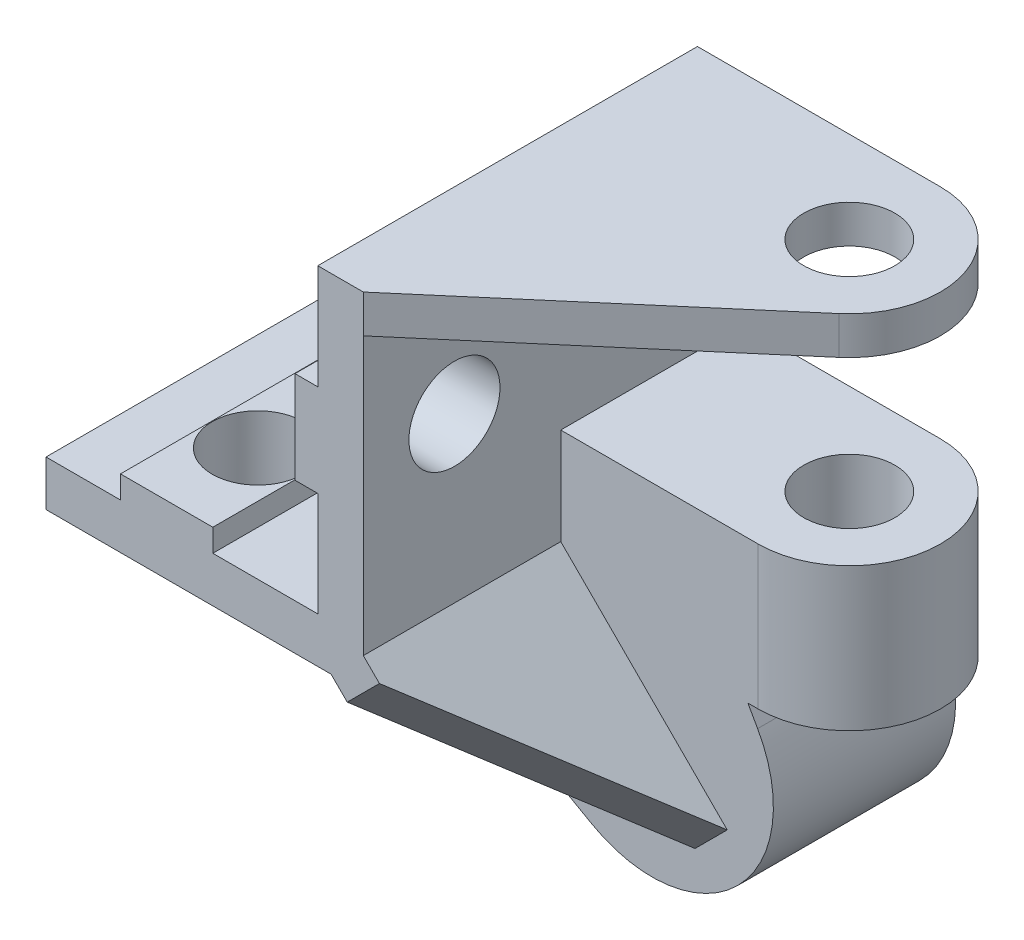
ISO-10303-21;
HEADER;
FILE_DESCRIPTION(('STEP AP214'),'2;1');
FILE_NAME('part.step','',(''),(''),'','','');
FILE_SCHEMA(('AUTOMOTIVE_DESIGN { 1 0 10303 214 1 1 1 1 }'));
ENDSEC;
DATA;
#1=APPLICATION_CONTEXT('core data for automotive mechanical design processes');
#2=APPLICATION_PROTOCOL_DEFINITION('international standard','automotive_design',2000,#1);
#3=PRODUCT_CONTEXT('',#1,'mechanical');
#4=PRODUCT('Part','Part','',(#3));
#5=PRODUCT_RELATED_PRODUCT_CATEGORY('part','',(#4));
#6=PRODUCT_DEFINITION_FORMATION('','',#4);
#7=PRODUCT_DEFINITION_CONTEXT('part definition',#1,'design');
#8=PRODUCT_DEFINITION('design','',#6,#7);
#9=PRODUCT_DEFINITION_SHAPE('','',#8);
#10=(LENGTH_UNIT() NAMED_UNIT(*) SI_UNIT(.MILLI.,.METRE.));
#11=(NAMED_UNIT(*) PLANE_ANGLE_UNIT() SI_UNIT($,.RADIAN.));
#12=(NAMED_UNIT(*) SI_UNIT($,.STERADIAN.) SOLID_ANGLE_UNIT());
#13=UNCERTAINTY_MEASURE_WITH_UNIT(LENGTH_MEASURE(1.E-05),#10,'distance_accuracy_value','');
#14=(GEOMETRIC_REPRESENTATION_CONTEXT(3) GLOBAL_UNCERTAINTY_ASSIGNED_CONTEXT((#13)) GLOBAL_UNIT_ASSIGNED_CONTEXT((#10,
#11,#12)) REPRESENTATION_CONTEXT('',''));
#15=CARTESIAN_POINT('',(0.,0.,0.));
#16=DIRECTION('',(0.,0.,1.));
#17=DIRECTION('',(1.,0.,0.));
#18=AXIS2_PLACEMENT_3D('',#15,#16,#17);
#19=CARTESIAN_POINT('',(230.088719843331,41.429550862018,-25.));
#20=DIRECTION('',(1.,0.,0.));
#21=DIRECTION('',(0.,0.,-1.));
#22=AXIS2_PLACEMENT_3D('',#19,#20,#21);
#23=PLANE('',#22);
#24=CARTESIAN_POINT('',(230.088719843331,54.3395711724228,-6.));
#25=DIRECTION('',(1.,0.,0.));
#26=DIRECTION('',(0.,0.,-1.));
#27=AXIS2_PLACEMENT_3D('',#24,#25,#26);
#28=CIRCLE('',#27,3.);
#29=CARTESIAN_POINT('',(230.088719843331,54.3395711724228,-9.));
#30=VERTEX_POINT('',#29);
#31=EDGE_CURVE('E315',#30,#30,#28,.T.);
#32=ORIENTED_EDGE('',*,*,#31,.F.);
#33=EDGE_LOOP('',(#32));
#34=FACE_BOUND('',#33,.T.);
#35=DIRECTION('',(0.,0.,1.));
#36=VECTOR('',#35,1.);
#37=CARTESIAN_POINT('',(230.088719843331,61.7829711724228,-25.));
#38=LINE('',#37,#36);
#39=CARTESIAN_POINT('',(230.088719843331,61.7829711724228,-25.));
#40=VERTEX_POINT('',#39);
#41=CARTESIAN_POINT('',(230.088719843331,61.7829711724228,0.));
#42=VERTEX_POINT('',#41);
#43=EDGE_CURVE('E228',#40,#42,#38,.T.);
#44=ORIENTED_EDGE('',*,*,#43,.T.);
#45=DIRECTION('',(0.,1.,0.));
#46=VECTOR('',#45,1.);
#47=CARTESIAN_POINT('',(230.088719843331,41.429550862018,0.));
#48=LINE('',#47,#46);
#49=CARTESIAN_POINT('',(230.088719843331,43.5504865618593,0.));
#50=VERTEX_POINT('',#49);
#51=EDGE_CURVE('E231',#50,#42,#48,.T.);
#52=ORIENTED_EDGE('',*,*,#51,.F.);
#53=DIRECTION('',(0.,0.,-1.));
#54=VECTOR('',#53,1.);
#55=CARTESIAN_POINT('',(230.088719843331,43.5504865618593,-25.));
#56=LINE('',#55,#54);
#57=CARTESIAN_POINT('',(230.088719843331,43.5504865618593,-13.));
#58=VERTEX_POINT('',#57);
#59=EDGE_CURVE('E324',#50,#58,#56,.T.);
#60=ORIENTED_EDGE('',*,*,#59,.T.);
#61=DIRECTION('',(0.,1.,0.));
#62=VECTOR('',#61,1.);
#63=CARTESIAN_POINT('',(230.088719843331,41.429550862018,-13.));
#64=LINE('',#63,#62);
#65=CARTESIAN_POINT('',(230.088719843331,49.9129711724228,-13.));
#66=VERTEX_POINT('',#65);
#67=EDGE_CURVE('E65',#58,#66,#64,.T.);
#68=ORIENTED_EDGE('',*,*,#67,.T.);
#69=DIRECTION('',(0.,0.,1.));
#70=VECTOR('',#69,1.);
#71=CARTESIAN_POINT('',(230.088719843331,49.9129711724228,-25.));
#72=LINE('',#71,#70);
#73=CARTESIAN_POINT('',(230.088719843331,49.9129711724228,-25.));
#74=VERTEX_POINT('',#73);
#75=EDGE_CURVE('E518',#74,#66,#72,.T.);
#76=ORIENTED_EDGE('',*,*,#75,.F.);
#77=DIRECTION('',(0.,1.,0.));
#78=VECTOR('',#77,1.);
#79=CARTESIAN_POINT('',(230.088719843331,41.429550862018,-25.));
#80=LINE('',#79,#78);
#81=EDGE_CURVE('E234',#74,#40,#80,.T.);
#82=ORIENTED_EDGE('',*,*,#81,.T.);
#83=EDGE_LOOP('',(#44,#52,#60,#68,#76,#82));
#84=FACE_BOUND('',#83,.T.);
#85=ADVANCED_FACE('F38',(#34,#84),#23,.T.);
#86=CARTESIAN_POINT('',(243.088719843331,61.7829711724228,-19.));
#87=DIRECTION('',(0.,1.,0.));
#88=DIRECTION('',(-1.,0.,0.));
#89=AXIS2_PLACEMENT_3D('',#86,#87,#88);
#90=CYLINDRICAL_SURFACE('',#89,6.);
#91=CARTESIAN_POINT('',(243.088719843331,64.2829711724228,-19.));
#92=DIRECTION('',(0.,1.,0.));
#93=DIRECTION('',(-1.,0.,0.));
#94=AXIS2_PLACEMENT_3D('',#91,#92,#93);
#95=CIRCLE('',#94,6.);
#96=CARTESIAN_POINT('',(246.986411594051,64.2829711724228,-14.4384214337176));
#97=VERTEX_POINT('',#96);
#98=CARTESIAN_POINT('',(243.088719843331,64.2829711724228,-25.));
#99=VERTEX_POINT('',#98);
#100=EDGE_CURVE('E525',#97,#99,#95,.T.);
#101=ORIENTED_EDGE('',*,*,#100,.F.);
#102=DIRECTION('',(0.,1.,0.));
#103=VECTOR('',#102,1.);
#104=CARTESIAN_POINT('',(246.986411594051,61.7829711724228,-14.4384214337176));
#105=LINE('',#104,#103);
#106=CARTESIAN_POINT('',(246.986411594051,61.7829711724228,-14.4384214337176));
#107=VERTEX_POINT('',#106);
#108=EDGE_CURVE('E251',#107,#97,#105,.T.);
#109=ORIENTED_EDGE('',*,*,#108,.F.);
#110=CARTESIAN_POINT('',(243.088719843331,61.7829711724228,-19.));
#111=DIRECTION('',(0.,1.,0.));
#112=DIRECTION('',(-1.,0.,0.));
#113=AXIS2_PLACEMENT_3D('',#110,#111,#112);
#114=CIRCLE('',#113,6.);
#115=CARTESIAN_POINT('',(243.088719843331,61.7829711724228,-25.));
#116=VERTEX_POINT('',#115);
#117=EDGE_CURVE('E255',#107,#116,#114,.T.);
#118=ORIENTED_EDGE('',*,*,#117,.T.);
#119=DIRECTION('',(0.,1.,0.));
#120=VECTOR('',#119,1.);
#121=CARTESIAN_POINT('',(243.088719843331,61.7829711724228,-25.));
#122=LINE('',#121,#120);
#123=EDGE_CURVE('E241',#116,#99,#122,.T.);
#124=ORIENTED_EDGE('',*,*,#123,.T.);
#125=EDGE_LOOP('',(#101,#109,#118,#124));
#126=FACE_BOUND('',#125,.T.);
#127=ADVANCED_FACE('F556',(#126),#90,.T.);
#128=CARTESIAN_POINT('',(237.925828105949,48.429550862018,-13.));
#129=DIRECTION('',(0.870376693630431,0.492386444964683,0.));
#130=DIRECTION('',(-0.492386444964683,0.870376693630431,0.));
#131=AXIS2_PLACEMENT_3D('',#128,#129,#130);
#132=PLANE('',#131);
#133=DIRECTION('',(0.492386444964683,-0.870376693630431,0.));
#134=VECTOR('',#133,1.);
#135=CARTESIAN_POINT('',(237.925828105949,48.429550862018,-25.));
#136=LINE('',#135,#134);
#137=CARTESIAN_POINT('',(242.409313998279,40.5042278422419,-25.));
#138=VERTEX_POINT('',#137);
#139=CARTESIAN_POINT('',(243.051733392374,39.3686424217354,-25.));
#140=VERTEX_POINT('',#139);
#141=EDGE_CURVE('E355',#138,#140,#136,.T.);
#142=ORIENTED_EDGE('',*,*,#141,.F.);
#143=DIRECTION('',(0.,0.,1.));
#144=VECTOR('',#143,1.);
#145=CARTESIAN_POINT('',(242.409313998279,40.5042278422419,-13.));
#146=LINE('',#145,#144);
#147=CARTESIAN_POINT('',(242.409313998279,40.5042278422419,-13.));
#148=VERTEX_POINT('',#147);
#149=EDGE_CURVE('E495',#138,#148,#146,.T.);
#150=ORIENTED_EDGE('',*,*,#149,.T.);
#151=DIRECTION('',(0.492386444964683,-0.870376693630431,0.));
#152=VECTOR('',#151,1.);
#153=CARTESIAN_POINT('',(237.925828105949,48.429550862018,-13.));
#154=LINE('',#153,#152);
#155=CARTESIAN_POINT('',(243.051733392374,39.3686424217354,-13.));
#156=VERTEX_POINT('',#155);
#157=EDGE_CURVE('E335',#148,#156,#154,.T.);
#158=ORIENTED_EDGE('',*,*,#157,.T.);
#159=DIRECTION('',(0.,0.,-1.));
#160=VECTOR('',#159,1.);
#161=CARTESIAN_POINT('',(243.051733392374,39.3686424217354,-13.));
#162=LINE('',#161,#160);
#163=EDGE_CURVE('E368',#156,#140,#162,.T.);
#164=ORIENTED_EDGE('',*,*,#163,.T.);
#165=EDGE_LOOP('',(#142,#150,#158,#164));
#166=FACE_BOUND('',#165,.T.);
#167=ADVANCED_FACE('F562',(#166),#132,.T.);
#168=CARTESIAN_POINT('',(209.195275179556,41.429550862018,-25.));
#169=DIRECTION('',(0.,-1.,0.));
#170=DIRECTION('',(0.,0.,-1.));
#171=AXIS2_PLACEMENT_3D('',#168,#169,#170);
#172=PLANE('',#171);
#173=DIRECTION('',(0.,0.,-1.));
#174=VECTOR('',#173,1.);
#175=CARTESIAN_POINT('',(227.967014646705,41.429550862018,-25.));
#176=LINE('',#175,#174);
#177=CARTESIAN_POINT('',(227.967014646705,41.429550862018,0.));
#178=VERTEX_POINT('',#177);
#179=CARTESIAN_POINT('',(227.967014646705,41.429550862018,-13.));
#180=VERTEX_POINT('',#179);
#181=EDGE_CURVE('E339',#178,#180,#176,.T.);
#182=ORIENTED_EDGE('',*,*,#181,.F.);
#183=DIRECTION('',(1.,0.,0.));
#184=VECTOR('',#183,1.);
#185=CARTESIAN_POINT('',(209.195275179556,41.429550862018,0.));
#186=LINE('',#185,#184);
#187=CARTESIAN_POINT('',(209.195275179556,41.429550862018,0.));
#188=VERTEX_POINT('',#187);
#189=EDGE_CURVE('E264',#188,#178,#186,.T.);
#190=ORIENTED_EDGE('',*,*,#189,.F.);
#191=DIRECTION('',(0.,0.,1.));
#192=VECTOR('',#191,1.);
#193=CARTESIAN_POINT('',(209.195275179556,41.429550862018,-25.));
#194=LINE('',#193,#192);
#195=CARTESIAN_POINT('',(209.195275179556,41.429550862018,-13.));
#196=VERTEX_POINT('',#195);
#197=EDGE_CURVE('E279',#196,#188,#194,.T.);
#198=ORIENTED_EDGE('',*,*,#197,.F.);
#199=DIRECTION('',(1.,0.,0.));
#200=VECTOR('',#199,1.);
#201=CARTESIAN_POINT('',(209.195275179556,41.429550862018,-13.));
#202=LINE('',#201,#200);
#203=EDGE_CURVE('E336',#196,#180,#202,.T.);
#204=ORIENTED_EDGE('',*,*,#203,.T.);
#205=EDGE_LOOP('',(#182,#190,#198,#204));
#206=FACE_BOUND('',#205,.T.);
#207=CARTESIAN_POINT('',(217.138695007103,41.429550862018,-6.));
#208=DIRECTION('',(0.,-1.,0.));
#209=DIRECTION('',(0.,0.,-1.));
#210=AXIS2_PLACEMENT_3D('',#207,#208,#209);
#211=CIRCLE('',#210,2.99999999999999);
#212=CARTESIAN_POINT('',(217.138695007103,41.429550862018,-8.99999999999999));
#213=VERTEX_POINT('',#212);
#214=EDGE_CURVE('E320',#213,#213,#211,.T.);
#215=ORIENTED_EDGE('',*,*,#214,.F.);
#216=EDGE_LOOP('',(#215));
#217=FACE_BOUND('',#216,.T.);
#218=ADVANCED_FACE('F455',(#206,#217),#172,.T.);
#219=CARTESIAN_POINT('',(209.195275179556,44.429550862018,-25.));
#220=DIRECTION('',(-1.,0.,0.));
#221=DIRECTION('',(0.,-1.,0.));
#222=AXIS2_PLACEMENT_3D('',#219,#220,#221);
#223=PLANE('',#222);
#224=DIRECTION('',(0.,-1.,0.));
#225=VECTOR('',#224,1.);
#226=CARTESIAN_POINT('',(209.195275179556,44.429550862018,0.));
#227=LINE('',#226,#225);
#228=CARTESIAN_POINT('',(209.195275179556,44.429550862018,0.));
#229=VERTEX_POINT('',#228);
#230=EDGE_CURVE('E272',#229,#188,#227,.T.);
#231=ORIENTED_EDGE('',*,*,#230,.F.);
#232=DIRECTION('',(0.,0.,1.));
#233=VECTOR('',#232,1.);
#234=CARTESIAN_POINT('',(209.195275179556,44.429550862018,-25.));
#235=LINE('',#234,#233);
#236=CARTESIAN_POINT('',(209.195275179556,44.429550862018,-25.));
#237=VERTEX_POINT('',#236);
#238=EDGE_CURVE('E280',#237,#229,#235,.T.);
#239=ORIENTED_EDGE('',*,*,#238,.F.);
#240=DIRECTION('',(0.,-1.,0.));
#241=VECTOR('',#240,1.);
#242=CARTESIAN_POINT('',(209.195275179556,44.429550862018,-25.));
#243=LINE('',#242,#241);
#244=CARTESIAN_POINT('',(209.195275179556,41.429550862018,-25.));
#245=VERTEX_POINT('',#244);
#246=EDGE_CURVE('E405',#237,#245,#243,.T.);
#247=ORIENTED_EDGE('',*,*,#246,.T.);
#248=EDGE_CURVE('E276',#245,#196,#194,.T.);
#249=ORIENTED_EDGE('',*,*,#248,.T.);
#250=ORIENTED_EDGE('',*,*,#197,.T.);
#251=EDGE_LOOP('',(#231,#239,#247,#249,#250));
#252=FACE_BOUND('',#251,.T.);
#253=ADVANCED_FACE('F450',(#252),#223,.T.);
#254=CARTESIAN_POINT('',(214.098687418949,44.429550862018,-25.));
#255=DIRECTION('',(0.,1.,0.));
#256=DIRECTION('',(-1.,0.,0.));
#257=AXIS2_PLACEMENT_3D('',#254,#255,#256);
#258=PLANE('',#257);
#259=DIRECTION('',(-1.,0.,0.));
#260=VECTOR('',#259,1.);
#261=CARTESIAN_POINT('',(214.098687418949,44.429550862018,0.));
#262=LINE('',#261,#260);
#263=CARTESIAN_POINT('',(214.098687418949,44.429550862018,0.));
#264=VERTEX_POINT('',#263);
#265=EDGE_CURVE('E441',#264,#229,#262,.T.);
#266=ORIENTED_EDGE('',*,*,#265,.F.);
#267=DIRECTION('',(0.,0.,1.));
#268=VECTOR('',#267,1.);
#269=CARTESIAN_POINT('',(214.098687418949,44.429550862018,-25.));
#270=LINE('',#269,#268);
#271=CARTESIAN_POINT('',(214.098687418949,44.429550862018,-25.));
#272=VERTEX_POINT('',#271);
#273=EDGE_CURVE('E283',#272,#264,#270,.T.);
#274=ORIENTED_EDGE('',*,*,#273,.F.);
#275=DIRECTION('',(-1.,0.,0.));
#276=VECTOR('',#275,1.);
#277=CARTESIAN_POINT('',(214.098687418949,44.429550862018,-25.));
#278=LINE('',#277,#276);
#279=EDGE_CURVE('E401',#272,#237,#278,.T.);
#280=ORIENTED_EDGE('',*,*,#279,.T.);
#281=ORIENTED_EDGE('',*,*,#238,.T.);
#282=EDGE_LOOP('',(#266,#274,#280,#281));
#283=FACE_BOUND('',#282,.T.);
#284=ADVANCED_FACE('F571',(#283),#258,.T.);
#285=CARTESIAN_POINT('',(214.098687418949,45.9171950677049,-25.));
#286=DIRECTION('',(-1.,0.,0.));
#287=DIRECTION('',(0.,0.,1.));
#288=AXIS2_PLACEMENT_3D('',#285,#286,#287);
#289=PLANE('',#288);
#290=DIRECTION('',(0.,-1.,0.));
#291=VECTOR('',#290,1.);
#292=CARTESIAN_POINT('',(214.098687418949,45.9171950677049,0.));
#293=LINE('',#292,#291);
#294=CARTESIAN_POINT('',(214.098687418949,45.9171950677049,0.));
#295=VERTEX_POINT('',#294);
#296=EDGE_CURVE('E438',#295,#264,#293,.T.);
#297=ORIENTED_EDGE('',*,*,#296,.F.);
#298=DIRECTION('',(0.,0.,1.));
#299=VECTOR('',#298,1.);
#300=CARTESIAN_POINT('',(214.098687418949,45.9171950677049,-25.));
#301=LINE('',#300,#299);
#302=CARTESIAN_POINT('',(214.098687418949,45.9171950677049,-25.));
#303=VERTEX_POINT('',#302);
#304=EDGE_CURVE('E286',#303,#295,#301,.T.);
#305=ORIENTED_EDGE('',*,*,#304,.F.);
#306=DIRECTION('',(0.,-1.,0.));
#307=VECTOR('',#306,1.);
#308=CARTESIAN_POINT('',(214.098687418949,45.9171950677049,-25.));
#309=LINE('',#308,#307);
#310=EDGE_CURVE('E397',#303,#272,#309,.T.);
#311=ORIENTED_EDGE('',*,*,#310,.T.);
#312=ORIENTED_EDGE('',*,*,#273,.T.);
#313=EDGE_LOOP('',(#297,#305,#311,#312));
#314=FACE_BOUND('',#313,.T.);
#315=ADVANCED_FACE('F574',(#314),#289,.T.);
#316=CARTESIAN_POINT('',(220.178702595257,45.9171950677049,-25.));
#317=DIRECTION('',(0.,1.,0.));
#318=DIRECTION('',(0.,0.,1.));
#319=AXIS2_PLACEMENT_3D('',#316,#317,#318);
#320=PLANE('',#319);
#321=CARTESIAN_POINT('',(217.138695007103,45.9171950677049,-6.));
#322=DIRECTION('',(0.,1.,0.));
#323=DIRECTION('',(0.,0.,1.));
#324=AXIS2_PLACEMENT_3D('',#321,#322,#323);
#325=CIRCLE('',#324,2.99999999999999);
#326=CARTESIAN_POINT('',(217.138695007103,45.9171950677049,-3.00000000000001));
#327=VERTEX_POINT('',#326);
#328=EDGE_CURVE('E316',#327,#327,#325,.T.);
#329=ORIENTED_EDGE('',*,*,#328,.F.);
#330=EDGE_LOOP('',(#329));
#331=FACE_BOUND('',#330,.T.);
#332=DIRECTION('',(-1.,0.,0.));
#333=VECTOR('',#332,1.);
#334=CARTESIAN_POINT('',(220.178702595257,45.9171950677049,0.));
#335=LINE('',#334,#333);
#336=CARTESIAN_POINT('',(220.178702595257,45.9171950677049,0.));
#337=VERTEX_POINT('',#336);
#338=EDGE_CURVE('E434',#337,#295,#335,.T.);
#339=ORIENTED_EDGE('',*,*,#338,.F.);
#340=DIRECTION('',(0.,0.,1.));
#341=VECTOR('',#340,1.);
#342=CARTESIAN_POINT('',(220.178702595257,45.9171950677049,-25.));
#343=LINE('',#342,#341);
#344=CARTESIAN_POINT('',(220.178702595257,45.9171950677049,-25.));
#345=VERTEX_POINT('',#344);
#346=EDGE_CURVE('E289',#345,#337,#343,.T.);
#347=ORIENTED_EDGE('',*,*,#346,.F.);
#348=DIRECTION('',(-1.,0.,0.));
#349=VECTOR('',#348,1.);
#350=CARTESIAN_POINT('',(220.178702595257,45.9171950677049,-25.));
#351=LINE('',#350,#349);
#352=EDGE_CURVE('E393',#345,#303,#351,.T.);
#353=ORIENTED_EDGE('',*,*,#352,.T.);
#354=ORIENTED_EDGE('',*,*,#304,.T.);
#355=EDGE_LOOP('',(#339,#347,#353,#354));
#356=FACE_BOUND('',#355,.T.);
#357=ADVANCED_FACE('F578',(#331,#356),#320,.T.);
#358=CARTESIAN_POINT('',(220.178702595257,45.9171950677049,-25.));
#359=DIRECTION('',(1.,0.,0.));
#360=DIRECTION('',(0.,1.,0.));
#361=AXIS2_PLACEMENT_3D('',#358,#359,#360);
#362=PLANE('',#361);
#363=DIRECTION('',(0.,1.,0.));
#364=VECTOR('',#363,1.);
#365=CARTESIAN_POINT('',(220.178702595257,45.9171950677049,0.));
#366=LINE('',#365,#364);
#367=CARTESIAN_POINT('',(220.178702595257,44.429550862018,0.));
#368=VERTEX_POINT('',#367);
#369=EDGE_CURVE('E430',#368,#337,#366,.T.);
#370=ORIENTED_EDGE('',*,*,#369,.F.);
#371=DIRECTION('',(0.,0.,1.));
#372=VECTOR('',#371,1.);
#373=CARTESIAN_POINT('',(220.178702595257,44.429550862018,-25.));
#374=LINE('',#373,#372);
#375=CARTESIAN_POINT('',(220.178702595257,44.429550862018,-25.));
#376=VERTEX_POINT('',#375);
#377=EDGE_CURVE('E292',#376,#368,#374,.T.);
#378=ORIENTED_EDGE('',*,*,#377,.F.);
#379=DIRECTION('',(0.,1.,0.));
#380=VECTOR('',#379,1.);
#381=CARTESIAN_POINT('',(220.178702595257,45.9171950677049,-25.));
#382=LINE('',#381,#380);
#383=EDGE_CURVE('E390',#376,#345,#382,.T.);
#384=ORIENTED_EDGE('',*,*,#383,.T.);
#385=ORIENTED_EDGE('',*,*,#346,.T.);
#386=EDGE_LOOP('',(#370,#378,#384,#385));
#387=FACE_BOUND('',#386,.T.);
#388=ADVANCED_FACE('F582',(#387),#362,.T.);
#389=CARTESIAN_POINT('',(227.088719843331,44.429550862018,-25.));
#390=DIRECTION('',(0.,1.,0.));
#391=DIRECTION('',(0.,0.,1.));
#392=AXIS2_PLACEMENT_3D('',#389,#390,#391);
#393=PLANE('',#392);
#394=DIRECTION('',(-1.,0.,0.));
#395=VECTOR('',#394,1.);
#396=CARTESIAN_POINT('',(227.088719843331,44.429550862018,0.));
#397=LINE('',#396,#395);
#398=CARTESIAN_POINT('',(227.088719843331,44.429550862018,0.));
#399=VERTEX_POINT('',#398);
#400=EDGE_CURVE('E427',#399,#368,#397,.T.);
#401=ORIENTED_EDGE('',*,*,#400,.F.);
#402=DIRECTION('',(0.,0.,1.));
#403=VECTOR('',#402,1.);
#404=CARTESIAN_POINT('',(227.088719843331,44.429550862018,-25.));
#405=LINE('',#404,#403);
#406=CARTESIAN_POINT('',(227.088719843331,44.429550862018,-25.));
#407=VERTEX_POINT('',#406);
#408=EDGE_CURVE('E295',#407,#399,#405,.T.);
#409=ORIENTED_EDGE('',*,*,#408,.F.);
#410=DIRECTION('',(-1.,0.,0.));
#411=VECTOR('',#410,1.);
#412=CARTESIAN_POINT('',(227.088719843331,44.429550862018,-25.));
#413=LINE('',#412,#411);
#414=EDGE_CURVE('E387',#407,#376,#413,.T.);
#415=ORIENTED_EDGE('',*,*,#414,.T.);
#416=ORIENTED_EDGE('',*,*,#377,.T.);
#417=EDGE_LOOP('',(#401,#409,#415,#416));
#418=FACE_BOUND('',#417,.T.);
#419=ADVANCED_FACE('F586',(#418),#393,.T.);
#420=CARTESIAN_POINT('',(227.088719843331,51.2995711724228,-25.));
#421=DIRECTION('',(-1.,0.,0.));
#422=DIRECTION('',(0.,0.,1.));
#423=AXIS2_PLACEMENT_3D('',#420,#421,#422);
#424=PLANE('',#423);
#425=ORIENTED_EDGE('',*,*,#408,.T.);
#426=DIRECTION('',(0.,-1.,0.));
#427=VECTOR('',#426,1.);
#428=CARTESIAN_POINT('',(227.088719843331,51.2995711724228,0.));
#429=LINE('',#428,#427);
#430=CARTESIAN_POINT('',(227.088719843331,51.2995711724228,0.));
#431=VERTEX_POINT('',#430);
#432=EDGE_CURVE('E423',#431,#399,#429,.T.);
#433=ORIENTED_EDGE('',*,*,#432,.F.);
#434=DIRECTION('',(0.,0.,1.));
#435=VECTOR('',#434,1.);
#436=CARTESIAN_POINT('',(227.088719843331,51.2995711724228,-25.));
#437=LINE('',#436,#435);
#438=CARTESIAN_POINT('',(227.088719843331,51.2995711724228,-25.));
#439=VERTEX_POINT('',#438);
#440=EDGE_CURVE('E297',#439,#431,#437,.T.);
#441=ORIENTED_EDGE('',*,*,#440,.F.);
#442=DIRECTION('',(0.,-1.,0.));
#443=VECTOR('',#442,1.);
#444=CARTESIAN_POINT('',(227.088719843331,51.2995711724228,-25.));
#445=LINE('',#444,#443);
#446=EDGE_CURVE('E385',#439,#407,#445,.T.);
#447=ORIENTED_EDGE('',*,*,#446,.T.);
#448=EDGE_LOOP('',(#425,#433,#441,#447));
#449=FACE_BOUND('',#448,.T.);
#450=ADVANCED_FACE('F590',(#449),#424,.T.);
#451=CARTESIAN_POINT('',(225.590119843331,51.2995711724228,-25.));
#452=DIRECTION('',(0.,-1.,0.));
#453=DIRECTION('',(0.,0.,-1.));
#454=AXIS2_PLACEMENT_3D('',#451,#452,#453);
#455=PLANE('',#454);
#456=DIRECTION('',(1.,0.,0.));
#457=VECTOR('',#456,1.);
#458=CARTESIAN_POINT('',(225.590119843331,51.2995711724228,0.));
#459=LINE('',#458,#457);
#460=CARTESIAN_POINT('',(225.590119843331,51.2995711724228,0.));
#461=VERTEX_POINT('',#460);
#462=EDGE_CURVE('E419',#461,#431,#459,.T.);
#463=ORIENTED_EDGE('',*,*,#462,.F.);
#464=DIRECTION('',(0.,0.,1.));
#465=VECTOR('',#464,1.);
#466=CARTESIAN_POINT('',(225.590119843331,51.2995711724228,-25.));
#467=LINE('',#466,#465);
#468=CARTESIAN_POINT('',(225.590119843331,51.2995711724228,-25.));
#469=VERTEX_POINT('',#468);
#470=EDGE_CURVE('E300',#469,#461,#467,.T.);
#471=ORIENTED_EDGE('',*,*,#470,.F.);
#472=DIRECTION('',(1.,0.,0.));
#473=VECTOR('',#472,1.);
#474=CARTESIAN_POINT('',(225.590119843331,51.2995711724228,-25.));
#475=LINE('',#474,#473);
#476=EDGE_CURVE('E382',#469,#439,#475,.T.);
#477=ORIENTED_EDGE('',*,*,#476,.T.);
#478=ORIENTED_EDGE('',*,*,#440,.T.);
#479=EDGE_LOOP('',(#463,#471,#477,#478));
#480=FACE_BOUND('',#479,.T.);
#481=ADVANCED_FACE('F594',(#480),#455,.T.);
#482=CARTESIAN_POINT('',(225.590119843331,51.2995711724228,-25.));
#483=DIRECTION('',(-1.,0.,0.));
#484=DIRECTION('',(0.,0.,1.));
#485=AXIS2_PLACEMENT_3D('',#482,#483,#484);
#486=PLANE('',#485);
#487=CARTESIAN_POINT('',(225.590119843331,54.3395711724228,-6.));
#488=DIRECTION('',(-1.,0.,0.));
#489=DIRECTION('',(0.,0.,1.));
#490=AXIS2_PLACEMENT_3D('',#487,#488,#489);
#491=CIRCLE('',#490,3.);
#492=CARTESIAN_POINT('',(225.590119843331,54.3395711724228,-3.));
#493=VERTEX_POINT('',#492);
#494=EDGE_CURVE('E310',#493,#493,#491,.T.);
#495=ORIENTED_EDGE('',*,*,#494,.F.);
#496=EDGE_LOOP('',(#495));
#497=FACE_BOUND('',#496,.T.);
#498=DIRECTION('',(0.,-1.,0.));
#499=VECTOR('',#498,1.);
#500=CARTESIAN_POINT('',(225.590119843331,51.2995711724228,0.));
#501=LINE('',#500,#499);
#502=CARTESIAN_POINT('',(225.590119843331,57.3795711724228,0.));
#503=VERTEX_POINT('',#502);
#504=EDGE_CURVE('E415',#503,#461,#501,.T.);
#505=ORIENTED_EDGE('',*,*,#504,.F.);
#506=DIRECTION('',(0.,0.,1.));
#507=VECTOR('',#506,1.);
#508=CARTESIAN_POINT('',(225.590119843331,57.3795711724228,-25.));
#509=LINE('',#508,#507);
#510=CARTESIAN_POINT('',(225.590119843331,57.3795711724228,-25.));
#511=VERTEX_POINT('',#510);
#512=EDGE_CURVE('E303',#511,#503,#509,.T.);
#513=ORIENTED_EDGE('',*,*,#512,.F.);
#514=DIRECTION('',(0.,-1.,0.));
#515=VECTOR('',#514,1.);
#516=CARTESIAN_POINT('',(225.590119843331,51.2995711724228,-25.));
#517=LINE('',#516,#515);
#518=EDGE_CURVE('E379',#511,#469,#517,.T.);
#519=ORIENTED_EDGE('',*,*,#518,.T.);
#520=ORIENTED_EDGE('',*,*,#470,.T.);
#521=EDGE_LOOP('',(#505,#513,#519,#520));
#522=FACE_BOUND('',#521,.T.);
#523=ADVANCED_FACE('F598',(#497,#522),#486,.T.);
#524=CARTESIAN_POINT('',(225.590119843331,57.3795711724228,-25.));
#525=DIRECTION('',(0.,1.,0.));
#526=DIRECTION('',(0.,0.,1.));
#527=AXIS2_PLACEMENT_3D('',#524,#525,#526);
#528=PLANE('',#527);
#529=DIRECTION('',(-1.,0.,0.));
#530=VECTOR('',#529,1.);
#531=CARTESIAN_POINT('',(225.590119843331,57.3795711724228,0.));
#532=LINE('',#531,#530);
#533=CARTESIAN_POINT('',(227.088719843331,57.3795711724228,0.));
#534=VERTEX_POINT('',#533);
#535=EDGE_CURVE('E411',#534,#503,#532,.T.);
#536=ORIENTED_EDGE('',*,*,#535,.F.);
#537=DIRECTION('',(0.,0.,1.));
#538=VECTOR('',#537,1.);
#539=CARTESIAN_POINT('',(227.088719843331,57.3795711724228,-25.));
#540=LINE('',#539,#538);
#541=CARTESIAN_POINT('',(227.088719843331,57.3795711724228,-25.));
#542=VERTEX_POINT('',#541);
#543=EDGE_CURVE('E306',#542,#534,#540,.T.);
#544=ORIENTED_EDGE('',*,*,#543,.F.);
#545=DIRECTION('',(-1.,0.,0.));
#546=VECTOR('',#545,1.);
#547=CARTESIAN_POINT('',(225.590119843331,57.3795711724228,-25.));
#548=LINE('',#547,#546);
#549=EDGE_CURVE('E268',#542,#511,#548,.T.);
#550=ORIENTED_EDGE('',*,*,#549,.T.);
#551=ORIENTED_EDGE('',*,*,#512,.T.);
#552=EDGE_LOOP('',(#536,#544,#550,#551));
#553=FACE_BOUND('',#552,.T.);
#554=ADVANCED_FACE('F552',(#553),#528,.T.);
#555=CARTESIAN_POINT('',(227.088719843331,62.2829711724228,-25.));
#556=DIRECTION('',(-1.,0.,0.));
#557=DIRECTION('',(0.,0.,1.));
#558=AXIS2_PLACEMENT_3D('',#555,#556,#557);
#559=PLANE('',#558);
#560=DIRECTION('',(0.,-1.,0.));
#561=VECTOR('',#560,1.);
#562=CARTESIAN_POINT('',(227.088719843331,62.2829711724228,0.));
#563=LINE('',#562,#561);
#564=CARTESIAN_POINT('',(227.088719843331,64.2829711724228,0.));
#565=VERTEX_POINT('',#564);
#566=EDGE_CURVE('E314',#565,#534,#563,.T.);
#567=ORIENTED_EDGE('',*,*,#566,.F.);
#568=DIRECTION('',(0.,0.,1.));
#569=VECTOR('',#568,1.);
#570=CARTESIAN_POINT('',(227.088719843331,64.2829711724228,-25.));
#571=LINE('',#570,#569);
#572=CARTESIAN_POINT('',(227.088719843331,64.2829711724228,-25.));
#573=VERTEX_POINT('',#572);
#574=EDGE_CURVE('E521',#573,#565,#571,.T.);
#575=ORIENTED_EDGE('',*,*,#574,.F.);
#576=DIRECTION('',(0.,-1.,0.));
#577=VECTOR('',#576,1.);
#578=CARTESIAN_POINT('',(227.088719843331,62.2829711724228,-25.));
#579=LINE('',#578,#577);
#580=EDGE_CURVE('E263',#573,#542,#579,.T.);
#581=ORIENTED_EDGE('',*,*,#580,.T.);
#582=ORIENTED_EDGE('',*,*,#543,.T.);
#583=EDGE_LOOP('',(#567,#575,#581,#582));
#584=FACE_BOUND('',#583,.T.);
#585=ADVANCED_FACE('F40',(#584),#559,.T.);
#586=CARTESIAN_POINT('',(227.088719843331,62.2829711724228,-25.));
#587=DIRECTION('',(0.,0.,1.));
#588=DIRECTION('',(1.,0.,0.));
#589=AXIS2_PLACEMENT_3D('',#586,#587,#588);
#590=PLANE('',#589);
#591=ORIENTED_EDGE('',*,*,#81,.F.);
#592=DIRECTION('',(-1.,0.,0.));
#593=VECTOR('',#592,1.);
#594=CARTESIAN_POINT('',(227.088719843331,49.9129711724228,-25.));
#595=LINE('',#594,#593);
#596=CARTESIAN_POINT('',(243.088719843331,49.9129711724228,-25.));
#597=VERTEX_POINT('',#596);
#598=EDGE_CURVE('E499',#597,#74,#595,.T.);
#599=ORIENTED_EDGE('',*,*,#598,.F.);
#600=DIRECTION('',(0.,1.,0.));
#601=VECTOR('',#600,1.);
#602=CARTESIAN_POINT('',(243.088719843331,40.5042278422419,-25.));
#603=LINE('',#602,#601);
#604=CARTESIAN_POINT('',(243.088719843331,40.5042278422419,-25.));
#605=VERTEX_POINT('',#604);
#606=EDGE_CURVE('E514',#605,#597,#603,.T.);
#607=ORIENTED_EDGE('',*,*,#606,.F.);
#608=DIRECTION('',(-1.,0.,0.));
#609=VECTOR('',#608,1.);
#610=CARTESIAN_POINT('',(227.088719843331,40.504227842242,-25.));
#611=LINE('',#610,#609);
#612=EDGE_CURVE('E501',#605,#138,#611,.T.);
#613=ORIENTED_EDGE('',*,*,#612,.T.);
#614=ORIENTED_EDGE('',*,*,#141,.T.);
#615=CARTESIAN_POINT('',(236.088719843331,35.429550862018,-25.));
#616=DIRECTION('',(0.,0.,-1.));
#617=DIRECTION('',(-1.,0.,0.));
#618=AXIS2_PLACEMENT_3D('',#615,#616,#617);
#619=CIRCLE('',#618,8.);
#620=CARTESIAN_POINT('',(232.154834184776,28.4635948166917,-25.));
#621=VERTEX_POINT('',#620);
#622=EDGE_CURVE('E345',#140,#621,#619,.T.);
#623=ORIENTED_EDGE('',*,*,#622,.T.);
#624=DIRECTION('',(-0.870744505665787,0.491735707319333,0.));
#625=VECTOR('',#624,1.);
#626=CARTESIAN_POINT('',(232.154834184776,28.4635948166917,-25.));
#627=LINE('',#626,#625);
#628=EDGE_CURVE('E363',#621,#245,#627,.T.);
#629=ORIENTED_EDGE('',*,*,#628,.T.);
#630=ORIENTED_EDGE('',*,*,#246,.F.);
#631=ORIENTED_EDGE('',*,*,#279,.F.);
#632=ORIENTED_EDGE('',*,*,#310,.F.);
#633=ORIENTED_EDGE('',*,*,#352,.F.);
#634=ORIENTED_EDGE('',*,*,#383,.F.);
#635=ORIENTED_EDGE('',*,*,#414,.F.);
#636=ORIENTED_EDGE('',*,*,#446,.F.);
#637=ORIENTED_EDGE('',*,*,#476,.F.);
#638=ORIENTED_EDGE('',*,*,#518,.F.);
#639=ORIENTED_EDGE('',*,*,#549,.F.);
#640=ORIENTED_EDGE('',*,*,#580,.F.);
#641=DIRECTION('',(-1.,0.,0.));
#642=VECTOR('',#641,1.);
#643=CARTESIAN_POINT('',(227.088719843331,64.2829711724228,-25.));
#644=LINE('',#643,#642);
#645=EDGE_CURVE('E527',#99,#573,#644,.T.);
#646=ORIENTED_EDGE('',*,*,#645,.F.);
#647=ORIENTED_EDGE('',*,*,#123,.F.);
#648=DIRECTION('',(-1.,0.,0.));
#649=VECTOR('',#648,1.);
#650=CARTESIAN_POINT('',(227.088719843331,61.7829711724228,-25.));
#651=LINE('',#650,#649);
#652=EDGE_CURVE('E531',#116,#40,#651,.T.);
#653=ORIENTED_EDGE('',*,*,#652,.T.);
#654=EDGE_LOOP('',(#591,#599,#607,#613,#614,#623,#629,#630,#631,#632,#633,#634,#635,#636,#637,
#638,#639,#640,#646,#647,#653));
#655=FACE_BOUND('',#654,.T.);
#656=CARTESIAN_POINT('',(236.088719843331,35.429550862018,-25.));
#657=DIRECTION('',(0.,0.,-1.));
#658=DIRECTION('',(-1.,0.,0.));
#659=AXIS2_PLACEMENT_3D('',#656,#657,#658);
#660=CIRCLE('',#659,4.85);
#661=CARTESIAN_POINT('',(231.238719843331,35.429550862018,-25.));
#662=VERTEX_POINT('',#661);
#663=EDGE_CURVE('E240',#662,#662,#660,.T.);
#664=ORIENTED_EDGE('',*,*,#663,.F.);
#665=EDGE_LOOP('',(#664));
#666=FACE_BOUND('',#665,.T.);
#667=ADVANCED_FACE('F542',(#655,#666),#590,.F.);
#668=CARTESIAN_POINT('',(227.088719843331,62.2829711724228,0.));
#669=DIRECTION('',(0.,0.,1.));
#670=DIRECTION('',(1.,0.,0.));
#671=AXIS2_PLACEMENT_3D('',#668,#669,#670);
#672=PLANE('',#671);
#673=ORIENTED_EDGE('',*,*,#566,.T.);
#674=ORIENTED_EDGE('',*,*,#535,.T.);
#675=ORIENTED_EDGE('',*,*,#504,.T.);
#676=ORIENTED_EDGE('',*,*,#462,.T.);
#677=ORIENTED_EDGE('',*,*,#432,.T.);
#678=ORIENTED_EDGE('',*,*,#400,.T.);
#679=ORIENTED_EDGE('',*,*,#369,.T.);
#680=ORIENTED_EDGE('',*,*,#338,.T.);
#681=ORIENTED_EDGE('',*,*,#296,.T.);
#682=ORIENTED_EDGE('',*,*,#265,.T.);
#683=ORIENTED_EDGE('',*,*,#230,.T.);
#684=ORIENTED_EDGE('',*,*,#189,.T.);
#685=DIRECTION('',(-0.707235019011738,0.706978520100481,0.));
#686=VECTOR('',#685,1.);
#687=CARTESIAN_POINT('',(229.02825206318,40.3686983335004,0.));
#688=LINE('',#687,#686);
#689=CARTESIAN_POINT('',(229.02825206318,40.3686983335004,0.));
#690=VERTEX_POINT('',#689);
#691=EDGE_CURVE('E461',#690,#178,#688,.T.);
#692=ORIENTED_EDGE('',*,*,#691,.F.);
#693=DIRECTION('',(0.706978520100479,0.707235019011741,0.));
#694=VECTOR('',#693,1.);
#695=CARTESIAN_POINT('',(229.02825206318,40.3686983335004,0.));
#696=LINE('',#695,#694);
#697=CARTESIAN_POINT('',(231.149187623481,42.4904033905356,0.));
#698=VERTEX_POINT('',#697);
#699=EDGE_CURVE('E347',#690,#698,#696,.T.);
#700=ORIENTED_EDGE('',*,*,#699,.T.);
#701=DIRECTION('',(-0.707235019011738,0.706978520100481,0.));
#702=VECTOR('',#701,1.);
#703=CARTESIAN_POINT('',(231.149187623481,42.4904033905356,0.));
#704=LINE('',#703,#702);
#705=EDGE_CURVE('E261',#698,#50,#704,.T.);
#706=ORIENTED_EDGE('',*,*,#705,.T.);
#707=ORIENTED_EDGE('',*,*,#51,.T.);
#708=DIRECTION('',(0.,1.,0.));
#709=VECTOR('',#708,1.);
#710=CARTESIAN_POINT('',(230.088719843331,61.7829711724228,0.));
#711=LINE('',#710,#709);
#712=CARTESIAN_POINT('',(230.088719843331,64.2829711724228,0.));
#713=VERTEX_POINT('',#712);
#714=EDGE_CURVE('E244',#42,#713,#711,.T.);
#715=ORIENTED_EDGE('',*,*,#714,.T.);
#716=DIRECTION('',(1.,0.,0.));
#717=VECTOR('',#716,1.);
#718=CARTESIAN_POINT('',(227.088719843331,64.2829711724228,0.));
#719=LINE('',#718,#717);
#720=EDGE_CURVE('E610',#565,#713,#719,.T.);
#721=ORIENTED_EDGE('',*,*,#720,.F.);
#722=EDGE_LOOP('',(#673,#674,#675,#676,#677,#678,#679,#680,#681,#682,#683,#684,#692,#700,#706,
#707,#715,#721));
#723=FACE_BOUND('',#722,.T.);
#724=ADVANCED_FACE('F259',(#723),#672,.T.);
#725=CARTESIAN_POINT('',(215.088719843331,54.3395711724228,-6.));
#726=DIRECTION('',(1.,0.,0.));
#727=DIRECTION('',(0.,0.,-1.));
#728=AXIS2_PLACEMENT_3D('',#725,#726,#727);
#729=CYLINDRICAL_SURFACE('',#728,3.);
#730=ORIENTED_EDGE('',*,*,#494,.T.);
#731=EDGE_LOOP('',(#730));
#732=FACE_BOUND('',#731,.T.);
#733=ORIENTED_EDGE('',*,*,#31,.T.);
#734=EDGE_LOOP('',(#733));
#735=FACE_BOUND('',#734,.T.);
#736=ADVANCED_FACE('F550',(#732,#735),#729,.F.);
#737=CARTESIAN_POINT('',(217.138695007103,56.429550862018,-6.));
#738=DIRECTION('',(0.,-1.,0.));
#739=DIRECTION('',(0.,0.,-1.));
#740=AXIS2_PLACEMENT_3D('',#737,#738,#739);
#741=CYLINDRICAL_SURFACE('',#740,2.99999999999999);
#742=ORIENTED_EDGE('',*,*,#328,.T.);
#743=EDGE_LOOP('',(#742));
#744=FACE_BOUND('',#743,.T.);
#745=ORIENTED_EDGE('',*,*,#214,.T.);
#746=EDGE_LOOP('',(#745));
#747=FACE_BOUND('',#746,.T.);
#748=ADVANCED_FACE('F634',(#744,#747),#741,.F.);
#749=CARTESIAN_POINT('',(236.088719843331,35.429550862018,-13.));
#750=DIRECTION('',(0.,0.,-1.));
#751=DIRECTION('',(-1.,0.,0.));
#752=AXIS2_PLACEMENT_3D('',#749,#750,#751);
#753=CYLINDRICAL_SURFACE('',#752,8.);
#754=ORIENTED_EDGE('',*,*,#622,.F.);
#755=ORIENTED_EDGE('',*,*,#163,.F.);
#756=CARTESIAN_POINT('',(236.088719843331,35.429550862018,-13.));
#757=DIRECTION('',(0.,0.,-1.));
#758=DIRECTION('',(-1.,0.,0.));
#759=AXIS2_PLACEMENT_3D('',#756,#757,#758);
#760=CIRCLE('',#759,8.);
#761=CARTESIAN_POINT('',(232.154834184776,28.4635948166917,-13.));
#762=VERTEX_POINT('',#761);
#763=EDGE_CURVE('E351',#156,#762,#760,.T.);
#764=ORIENTED_EDGE('',*,*,#763,.T.);
#765=DIRECTION('',(0.,0.,-1.));
#766=VECTOR('',#765,1.);
#767=CARTESIAN_POINT('',(232.154834184776,28.4635948166917,-13.));
#768=LINE('',#767,#766);
#769=EDGE_CURVE('E360',#762,#621,#768,.T.);
#770=ORIENTED_EDGE('',*,*,#769,.T.);
#771=EDGE_LOOP('',(#754,#755,#764,#770));
#772=FACE_BOUND('',#771,.T.);
#773=ADVANCED_FACE('F484',(#772),#753,.T.);
#774=CARTESIAN_POINT('',(232.154834184776,28.4635948166917,-13.));
#775=DIRECTION('',(-0.491735707319333,-0.870744505665787,0.));
#776=DIRECTION('',(0.870744505665787,-0.491735707319333,0.));
#777=AXIS2_PLACEMENT_3D('',#774,#775,#776);
#778=PLANE('',#777);
#779=ORIENTED_EDGE('',*,*,#628,.F.);
#780=ORIENTED_EDGE('',*,*,#769,.F.);
#781=DIRECTION('',(-0.870744505665787,0.491735707319333,0.));
#782=VECTOR('',#781,1.);
#783=CARTESIAN_POINT('',(232.154834184776,28.4635948166917,-13.));
#784=LINE('',#783,#782);
#785=EDGE_CURVE('E354',#762,#196,#784,.T.);
#786=ORIENTED_EDGE('',*,*,#785,.T.);
#787=ORIENTED_EDGE('',*,*,#248,.F.);
#788=EDGE_LOOP('',(#779,#780,#786,#787));
#789=FACE_BOUND('',#788,.T.);
#790=ADVANCED_FACE('F481',(#789),#778,.T.);
#791=CARTESIAN_POINT('',(236.088719843331,35.429550862018,-13.));
#792=DIRECTION('',(0.,0.,-1.));
#793=DIRECTION('',(-1.,0.,0.));
#794=AXIS2_PLACEMENT_3D('',#791,#792,#793);
#795=PLANE('',#794);
#796=ORIENTED_EDGE('',*,*,#157,.F.);
#797=DIRECTION('',(1.,0.,0.));
#798=VECTOR('',#797,1.);
#799=CARTESIAN_POINT('',(227.088719843331,40.504227842242,-13.));
#800=LINE('',#799,#798);
#801=CARTESIAN_POINT('',(243.088719843331,40.5042278422419,-13.));
#802=VERTEX_POINT('',#801);
#803=EDGE_CURVE('E487',#148,#802,#800,.T.);
#804=ORIENTED_EDGE('',*,*,#803,.T.);
#805=DIRECTION('',(0.,1.,0.));
#806=VECTOR('',#805,1.);
#807=CARTESIAN_POINT('',(243.088719843331,40.5042278422419,-13.));
#808=LINE('',#807,#806);
#809=CARTESIAN_POINT('',(243.088719843331,49.9129711724228,-13.));
#810=VERTEX_POINT('',#809);
#811=EDGE_CURVE('E509',#802,#810,#808,.T.);
#812=ORIENTED_EDGE('',*,*,#811,.T.);
#813=DIRECTION('',(1.,0.,0.));
#814=VECTOR('',#813,1.);
#815=CARTESIAN_POINT('',(227.088719843331,49.9129711724228,-13.));
#816=LINE('',#815,#814);
#817=EDGE_CURVE('E333',#66,#810,#816,.T.);
#818=ORIENTED_EDGE('',*,*,#817,.F.);
#819=ORIENTED_EDGE('',*,*,#67,.F.);
#820=DIRECTION('',(-0.707235019011738,0.706978520100481,0.));
#821=VECTOR('',#820,1.);
#822=CARTESIAN_POINT('',(237.150275658806,36.4914918206098,-13.));
#823=LINE('',#822,#821);
#824=CARTESIAN_POINT('',(241.050477889646,32.5927041091289,-13.));
#825=VERTEX_POINT('',#824);
#826=EDGE_CURVE('E47',#825,#58,#823,.T.);
#827=ORIENTED_EDGE('',*,*,#826,.F.);
#828=DIRECTION('',(0.706978520100479,0.707235019011741,0.));
#829=VECTOR('',#828,1.);
#830=CARTESIAN_POINT('',(238.929542329344,30.4709990520937,-13.));
#831=LINE('',#830,#829);
#832=CARTESIAN_POINT('',(238.929542329344,30.4709990520937,-13.));
#833=VERTEX_POINT('',#832);
#834=EDGE_CURVE('E340',#833,#825,#831,.T.);
#835=ORIENTED_EDGE('',*,*,#834,.F.);
#836=DIRECTION('',(-0.707235019011738,0.706978520100481,0.));
#837=VECTOR('',#836,1.);
#838=CARTESIAN_POINT('',(235.029340098504,34.3697867635746,-13.));
#839=LINE('',#838,#837);
#840=EDGE_CURVE('E11',#833,#180,#839,.T.);
#841=ORIENTED_EDGE('',*,*,#840,.T.);
#842=ORIENTED_EDGE('',*,*,#203,.F.);
#843=ORIENTED_EDGE('',*,*,#785,.F.);
#844=ORIENTED_EDGE('',*,*,#763,.F.);
#845=EDGE_LOOP('',(#796,#804,#812,#818,#819,#827,#835,#841,#842,#843,#844));
#846=FACE_BOUND('',#845,.T.);
#847=ADVANCED_FACE('F331',(#846),#795,.F.);
#848=CARTESIAN_POINT('',(238.929542329344,30.4709990520937,-13.));
#849=DIRECTION('',(-0.481238846197576,0.481064311231422,-0.732793491626299));
#850=DIRECTION('',(-0.835868338755599,0.,0.548929977561761));
#851=AXIS2_PLACEMENT_3D('',#848,#849,#850);
#852=PLANE('',#851);
#853=DIRECTION('',(-0.518257218982006,0.518069258249223,0.680451099367278));
#854=VECTOR('',#853,1.);
#855=CARTESIAN_POINT('',(241.050477889646,32.5927041091289,-13.));
#856=LINE('',#855,#854);
#857=EDGE_CURVE('E326',#825,#698,#856,.T.);
#858=ORIENTED_EDGE('',*,*,#857,.T.);
#859=ORIENTED_EDGE('',*,*,#699,.F.);
#860=DIRECTION('',(-0.518257218982006,0.518069258249223,0.680451099367278));
#861=VECTOR('',#860,1.);
#862=CARTESIAN_POINT('',(238.929542329344,30.4709990520937,-13.));
#863=LINE('',#862,#861);
#864=EDGE_CURVE('E462',#833,#690,#863,.T.);
#865=ORIENTED_EDGE('',*,*,#864,.F.);
#866=ORIENTED_EDGE('',*,*,#834,.T.);
#867=EDGE_LOOP('',(#858,#859,#865,#866));
#868=FACE_BOUND('',#867,.T.);
#869=ADVANCED_FACE('F476',(#868),#852,.F.);
#870=CARTESIAN_POINT('',(226.027708045518,43.3681541184633,0.));
#871=DIRECTION('',(-0.706978520100481,-0.707235019011738,0.));
#872=DIRECTION('',(0.707235019011738,-0.706978520100481,0.));
#873=AXIS2_PLACEMENT_3D('',#870,#871,#872);
#874=PLANE('',#873);
#875=ORIENTED_EDGE('',*,*,#691,.T.);
#876=ORIENTED_EDGE('',*,*,#181,.T.);
#877=ORIENTED_EDGE('',*,*,#840,.F.);
#878=ORIENTED_EDGE('',*,*,#864,.T.);
#879=EDGE_LOOP('',(#875,#876,#877,#878));
#880=FACE_BOUND('',#879,.T.);
#881=ADVANCED_FACE('F459',(#880),#874,.T.);
#882=CARTESIAN_POINT('',(228.148643605819,45.4898591754985,0.));
#883=DIRECTION('',(-0.706978520100481,-0.707235019011738,0.));
#884=DIRECTION('',(0.707235019011738,-0.706978520100481,0.));
#885=AXIS2_PLACEMENT_3D('',#882,#883,#884);
#886=PLANE('',#885);
#887=ORIENTED_EDGE('',*,*,#59,.F.);
#888=ORIENTED_EDGE('',*,*,#705,.F.);
#889=ORIENTED_EDGE('',*,*,#857,.F.);
#890=ORIENTED_EDGE('',*,*,#826,.T.);
#891=EDGE_LOOP('',(#887,#888,#889,#890));
#892=FACE_BOUND('',#891,.T.);
#893=ADVANCED_FACE('F323',(#892),#886,.F.);
#894=CARTESIAN_POINT('',(236.088719843331,35.429550862018,-16.));
#895=DIRECTION('',(0.,0.,-1.));
#896=DIRECTION('',(-1.,0.,0.));
#897=AXIS2_PLACEMENT_3D('',#894,#895,#896);
#898=CYLINDRICAL_SURFACE('',#897,4.85);
#899=CARTESIAN_POINT('',(236.088719843331,35.429550862018,-16.));
#900=DIRECTION('',(0.,0.,-1.));
#901=DIRECTION('',(-1.,0.,0.));
#902=AXIS2_PLACEMENT_3D('',#899,#900,#901);
#903=CIRCLE('',#902,4.85);
#904=CARTESIAN_POINT('',(231.238719843331,35.429550862018,-16.));
#905=VERTEX_POINT('',#904);
#906=EDGE_CURVE('E473',#905,#905,#903,.T.);
#907=ORIENTED_EDGE('',*,*,#906,.F.);
#908=EDGE_LOOP('',(#907));
#909=FACE_BOUND('',#908,.T.);
#910=ORIENTED_EDGE('',*,*,#663,.T.);
#911=EDGE_LOOP('',(#910));
#912=FACE_BOUND('',#911,.T.);
#913=ADVANCED_FACE('F540',(#909,#912),#898,.F.);
#914=CARTESIAN_POINT('',(236.088719843331,35.429550862018,-16.));
#915=DIRECTION('',(0.,0.,-1.));
#916=DIRECTION('',(-1.,0.,0.));
#917=AXIS2_PLACEMENT_3D('',#914,#915,#916);
#918=PLANE('',#917);
#919=ORIENTED_EDGE('',*,*,#906,.T.);
#920=EDGE_LOOP('',(#919));
#921=FACE_BOUND('',#920,.T.);
#922=ADVANCED_FACE('F704',(#921),#918,.T.);
#923=CARTESIAN_POINT('',(243.088719843331,61.7829711724228,-19.));
#924=DIRECTION('',(0.,1.,0.));
#925=DIRECTION('',(-1.,0.,0.));
#926=AXIS2_PLACEMENT_3D('',#923,#924,#925);
#927=PLANE('',#926);
#928=CARTESIAN_POINT('',(243.088719843331,61.7829711724228,-19.));
#929=DIRECTION('',(0.,1.,0.));
#930=DIRECTION('',(-1.,0.,0.));
#931=AXIS2_PLACEMENT_3D('',#928,#929,#930);
#932=CIRCLE('',#931,2.99999999999999);
#933=CARTESIAN_POINT('',(240.088719843331,61.7829711724228,-19.));
#934=VERTEX_POINT('',#933);
#935=EDGE_CURVE('E943',#934,#934,#932,.T.);
#936=ORIENTED_EDGE('',*,*,#935,.T.);
#937=EDGE_LOOP('',(#936));
#938=FACE_BOUND('',#937,.T.);
#939=ORIENTED_EDGE('',*,*,#43,.F.);
#940=ORIENTED_EDGE('',*,*,#652,.F.);
#941=ORIENTED_EDGE('',*,*,#117,.F.);
#942=DIRECTION('',(0.760263094380392,0.,-0.649615291786725));
#943=VECTOR('',#942,1.);
#944=CARTESIAN_POINT('',(230.088719843331,61.7829711724228,0.));
#945=LINE('',#944,#943);
#946=EDGE_CURVE('E246',#42,#107,#945,.T.);
#947=ORIENTED_EDGE('',*,*,#946,.F.);
#948=EDGE_LOOP('',(#939,#940,#941,#947));
#949=FACE_BOUND('',#948,.T.);
#950=ADVANCED_FACE('F254',(#938,#949),#927,.F.);
#951=CARTESIAN_POINT('',(243.088719843331,64.2829711724228,-19.));
#952=DIRECTION('',(0.,1.,0.));
#953=DIRECTION('',(-1.,0.,0.));
#954=AXIS2_PLACEMENT_3D('',#951,#952,#953);
#955=PLANE('',#954);
#956=CARTESIAN_POINT('',(243.088719843331,64.2829711724228,-19.));
#957=DIRECTION('',(0.,1.,0.));
#958=DIRECTION('',(-1.,0.,0.));
#959=AXIS2_PLACEMENT_3D('',#956,#957,#958);
#960=CIRCLE('',#959,2.99999999999999);
#961=CARTESIAN_POINT('',(240.088719843331,64.2829711724228,-19.));
#962=VERTEX_POINT('',#961);
#963=EDGE_CURVE('E940',#962,#962,#960,.T.);
#964=ORIENTED_EDGE('',*,*,#963,.F.);
#965=EDGE_LOOP('',(#964));
#966=FACE_BOUND('',#965,.T.);
#967=ORIENTED_EDGE('',*,*,#574,.T.);
#968=ORIENTED_EDGE('',*,*,#720,.T.);
#969=DIRECTION('',(0.760263094380392,0.,-0.649615291786725));
#970=VECTOR('',#969,1.);
#971=CARTESIAN_POINT('',(230.088719843331,64.2829711724228,0.));
#972=LINE('',#971,#970);
#973=EDGE_CURVE('E54',#713,#97,#972,.T.);
#974=ORIENTED_EDGE('',*,*,#973,.T.);
#975=ORIENTED_EDGE('',*,*,#100,.T.);
#976=ORIENTED_EDGE('',*,*,#645,.T.);
#977=EDGE_LOOP('',(#967,#968,#974,#975,#976));
#978=FACE_BOUND('',#977,.T.);
#979=ADVANCED_FACE('F615',(#966,#978),#955,.T.);
#980=CARTESIAN_POINT('',(243.088719843331,40.5042278422419,-19.));
#981=DIRECTION('',(0.,1.,0.));
#982=DIRECTION('',(-1.,0.,0.));
#983=AXIS2_PLACEMENT_3D('',#980,#981,#982);
#984=CYLINDRICAL_SURFACE('',#983,6.);
#985=CARTESIAN_POINT('',(243.088719843331,49.9129711724228,-19.));
#986=DIRECTION('',(0.,1.,0.));
#987=DIRECTION('',(-1.,0.,0.));
#988=AXIS2_PLACEMENT_3D('',#985,#986,#987);
#989=CIRCLE('',#988,6.);
#990=EDGE_CURVE('E504',#810,#597,#989,.T.);
#991=ORIENTED_EDGE('',*,*,#990,.F.);
#992=ORIENTED_EDGE('',*,*,#811,.F.);
#993=CARTESIAN_POINT('',(243.088719843331,40.5042278422419,-19.));
#994=DIRECTION('',(0.,1.,0.));
#995=DIRECTION('',(-1.,0.,0.));
#996=AXIS2_PLACEMENT_3D('',#993,#994,#995);
#997=CIRCLE('',#996,6.);
#998=EDGE_CURVE('E498',#802,#605,#997,.T.);
#999=ORIENTED_EDGE('',*,*,#998,.T.);
#1000=ORIENTED_EDGE('',*,*,#606,.T.);
#1001=EDGE_LOOP('',(#991,#992,#999,#1000));
#1002=FACE_BOUND('',#1001,.T.);
#1003=ADVANCED_FACE('F622',(#1002),#984,.T.);
#1004=CARTESIAN_POINT('',(243.088719843331,40.5042278422419,-19.));
#1005=DIRECTION('',(0.,1.,0.));
#1006=DIRECTION('',(-1.,0.,0.));
#1007=AXIS2_PLACEMENT_3D('',#1004,#1005,#1006);
#1008=PLANE('',#1007);
#1009=ORIENTED_EDGE('',*,*,#149,.F.);
#1010=ORIENTED_EDGE('',*,*,#612,.F.);
#1011=ORIENTED_EDGE('',*,*,#998,.F.);
#1012=ORIENTED_EDGE('',*,*,#803,.F.);
#1013=EDGE_LOOP('',(#1009,#1010,#1011,#1012));
#1014=FACE_BOUND('',#1013,.T.);
#1015=ADVANCED_FACE('F493',(#1014),#1008,.F.);
#1016=CARTESIAN_POINT('',(243.088719843331,49.9129711724228,-19.));
#1017=DIRECTION('',(0.,1.,0.));
#1018=DIRECTION('',(-1.,0.,0.));
#1019=AXIS2_PLACEMENT_3D('',#1016,#1017,#1018);
#1020=PLANE('',#1019);
#1021=CARTESIAN_POINT('',(243.088719843331,49.9129711724228,-19.));
#1022=DIRECTION('',(0.,1.,0.));
#1023=DIRECTION('',(-1.,0.,0.));
#1024=AXIS2_PLACEMENT_3D('',#1021,#1022,#1023);
#1025=CIRCLE('',#1024,2.99999999999999);
#1026=CARTESIAN_POINT('',(240.088719843331,49.9129711724228,-19.));
#1027=VERTEX_POINT('',#1026);
#1028=EDGE_CURVE('E42',#1027,#1027,#1025,.T.);
#1029=ORIENTED_EDGE('',*,*,#1028,.F.);
#1030=EDGE_LOOP('',(#1029));
#1031=FACE_BOUND('',#1030,.T.);
#1032=ORIENTED_EDGE('',*,*,#598,.T.);
#1033=ORIENTED_EDGE('',*,*,#75,.T.);
#1034=ORIENTED_EDGE('',*,*,#817,.T.);
#1035=ORIENTED_EDGE('',*,*,#990,.T.);
#1036=EDGE_LOOP('',(#1032,#1033,#1034,#1035));
#1037=FACE_BOUND('',#1036,.T.);
#1038=ADVANCED_FACE('F619',(#1031,#1037),#1020,.T.);
#1039=CARTESIAN_POINT('',(230.088719843331,61.7829711724228,0.));
#1040=DIRECTION('',(0.649615291786725,0.,0.760263094380392));
#1041=DIRECTION('',(0.760263094380392,0.,-0.649615291786725));
#1042=AXIS2_PLACEMENT_3D('',#1039,#1040,#1041);
#1043=PLANE('',#1042);
#1044=ORIENTED_EDGE('',*,*,#973,.F.);
#1045=ORIENTED_EDGE('',*,*,#714,.F.);
#1046=ORIENTED_EDGE('',*,*,#946,.T.);
#1047=ORIENTED_EDGE('',*,*,#108,.T.);
#1048=EDGE_LOOP('',(#1044,#1045,#1046,#1047));
#1049=FACE_BOUND('',#1048,.T.);
#1050=ADVANCED_FACE('F245',(#1049),#1043,.T.);
#1051=CARTESIAN_POINT('',(243.088719843331,43.2829711724228,-19.));
#1052=DIRECTION('',(0.,1.,0.));
#1053=DIRECTION('',(-1.,0.,0.));
#1054=AXIS2_PLACEMENT_3D('',#1051,#1052,#1053);
#1055=PLANE('',#1054);
#1056=CARTESIAN_POINT('',(243.088719843331,43.2829711724228,-19.));
#1057=DIRECTION('',(0.,1.,0.));
#1058=DIRECTION('',(-1.,0.,0.));
#1059=AXIS2_PLACEMENT_3D('',#1056,#1057,#1058);
#1060=CIRCLE('',#1059,2.99999999999999);
#1061=CARTESIAN_POINT('',(240.088719843331,43.2829711724228,-19.));
#1062=VERTEX_POINT('',#1061);
#1063=EDGE_CURVE('E947',#1062,#1062,#1060,.T.);
#1064=ORIENTED_EDGE('',*,*,#1063,.T.);
#1065=EDGE_LOOP('',(#1064));
#1066=FACE_BOUND('',#1065,.T.);
#1067=ADVANCED_FACE('F752',(#1066),#1055,.T.);
#1068=CARTESIAN_POINT('',(243.088719843331,43.2829711724228,-19.));
#1069=DIRECTION('',(0.,1.,0.));
#1070=DIRECTION('',(-1.,0.,0.));
#1071=AXIS2_PLACEMENT_3D('',#1068,#1069,#1070);
#1072=CYLINDRICAL_SURFACE('',#1071,2.99999999999999);
#1073=ORIENTED_EDGE('',*,*,#1028,.T.);
#1074=EDGE_LOOP('',(#1073));
#1075=FACE_BOUND('',#1074,.T.);
#1076=ORIENTED_EDGE('',*,*,#1063,.F.);
#1077=EDGE_LOOP('',(#1076));
#1078=FACE_BOUND('',#1077,.T.);
#1079=ADVANCED_FACE('F758',(#1075,#1078),#1072,.F.);
#1080=ORIENTED_EDGE('',*,*,#963,.T.);
#1081=EDGE_LOOP('',(#1080));
#1082=FACE_BOUND('',#1081,.T.);
#1083=ORIENTED_EDGE('',*,*,#935,.F.);
#1084=EDGE_LOOP('',(#1083));
#1085=FACE_BOUND('',#1084,.T.);
#1086=ADVANCED_FACE('F766',(#1082,#1085),#1072,.F.);
#1087=CLOSED_SHELL('',(#85,#127,#167,#218,#253,#284,#315,#357,#388,#419,#450,#481,#523,#554,
#585,#667,#724,#736,#748,#773,#790,#847,#869,#881,#893,#913,#922,#950,#979,#1003,#1015,#1038,
#1050,#1067,#1079,#1086));
#1088=MANIFOLD_SOLID_BREP('B2',#1087);
#1089=ADVANCED_BREP_SHAPE_REPRESENTATION('',(#18,#1088),#14);
#1090=SHAPE_DEFINITION_REPRESENTATION(#9,#1089);
ENDSEC;
END-ISO-10303-21;
